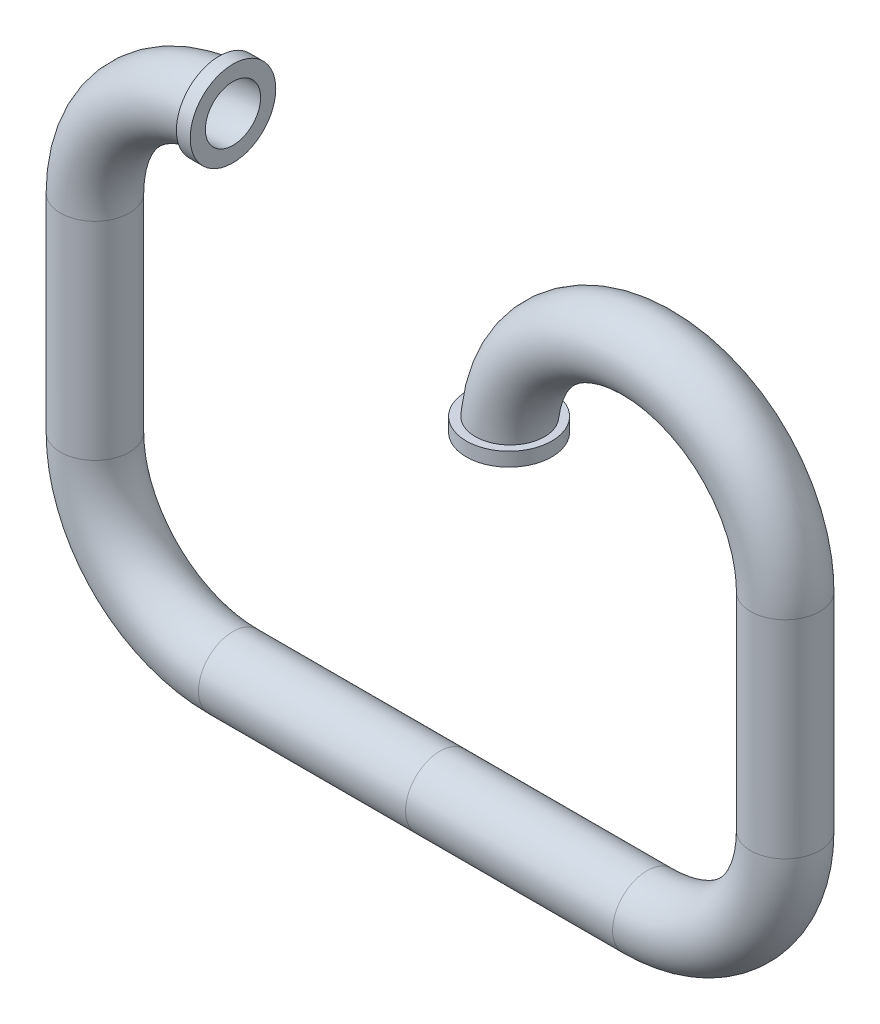
ISO-10303-21;
HEADER;
FILE_DESCRIPTION(('STEP AP214'),'2;1');
FILE_NAME('part.step','',(''),(''),'','','');
FILE_SCHEMA(('AUTOMOTIVE_DESIGN { 1 0 10303 214 1 1 1 1 }'));
ENDSEC;
DATA;
#1=APPLICATION_CONTEXT('core data for automotive mechanical design processes');
#2=APPLICATION_PROTOCOL_DEFINITION('international standard','automotive_design',2000,#1);
#3=PRODUCT_CONTEXT('',#1,'mechanical');
#4=PRODUCT('Part','Part','',(#3));
#5=PRODUCT_RELATED_PRODUCT_CATEGORY('part','',(#4));
#6=PRODUCT_DEFINITION_FORMATION('','',#4);
#7=PRODUCT_DEFINITION_CONTEXT('part definition',#1,'design');
#8=PRODUCT_DEFINITION('design','',#6,#7);
#9=PRODUCT_DEFINITION_SHAPE('','',#8);
#10=(LENGTH_UNIT() NAMED_UNIT(*) SI_UNIT(.MILLI.,.METRE.));
#11=(NAMED_UNIT(*) PLANE_ANGLE_UNIT() SI_UNIT($,.RADIAN.));
#12=(NAMED_UNIT(*) SI_UNIT($,.STERADIAN.) SOLID_ANGLE_UNIT());
#13=UNCERTAINTY_MEASURE_WITH_UNIT(LENGTH_MEASURE(1.E-05),#10,'distance_accuracy_value','');
#14=(GEOMETRIC_REPRESENTATION_CONTEXT(3) GLOBAL_UNCERTAINTY_ASSIGNED_CONTEXT((#13)) GLOBAL_UNIT_ASSIGNED_CONTEXT((#10,
#11,#12)) REPRESENTATION_CONTEXT('',''));
#15=CARTESIAN_POINT('',(0.,0.,0.));
#16=DIRECTION('',(0.,0.,1.));
#17=DIRECTION('',(1.,0.,0.));
#18=AXIS2_PLACEMENT_3D('',#15,#16,#17);
#19=CARTESIAN_POINT('',(-1.,0.,0.));
#20=DIRECTION('',(0.,0.,-1.));
#21=DIRECTION('',(-1.,0.,0.));
#22=AXIS2_PLACEMENT_3D('',#19,#20,#21);
#23=TOROIDAL_SURFACE('',#22,1.,0.25);
#24=CARTESIAN_POINT('',(-2.,0.,0.));
#25=DIRECTION('',(0.,-1.,0.));
#26=DIRECTION('',(1.,0.,0.));
#27=AXIS2_PLACEMENT_3D('',#24,#25,#26);
#28=CIRCLE('',#27,0.25);
#29=CARTESIAN_POINT('',(-1.75,0.,0.));
#30=VERTEX_POINT('',#29);
#31=EDGE_CURVE('E70',#30,#30,#28,.T.);
#32=ORIENTED_EDGE('',*,*,#31,.F.);
#33=EDGE_LOOP('',(#32));
#34=FACE_BOUND('',#33,.T.);
#35=CARTESIAN_POINT('',(-1.1,0.798598903682392,-0.156239637939055));
#36=CARTESIAN_POINT('',(-1.1,0.807484618255236,-0.167252077609579));
#37=CARTESIAN_POINT('',(-1.1,0.817311544826018,-0.177518916216291));
#38=CARTESIAN_POINT('',(-1.1,0.838559793603693,-0.196263733860563));
#39=CARTESIAN_POINT('',(-1.1,0.849983168244314,-0.204739374280309));
#40=CARTESIAN_POINT('',(-1.1,0.874081969106657,-0.21965059164289));
#41=CARTESIAN_POINT('',(-1.1,0.886756519343001,-0.226087582802604));
#42=CARTESIAN_POINT('',(-1.1,0.91300023448786,-0.236747922206686));
#43=CARTESIAN_POINT('',(-1.1,0.926569163740225,-0.240971850957424));
#44=CARTESIAN_POINT('',(-1.1,0.954266098089081,-0.247100376432861));
#45=CARTESIAN_POINT('',(-1.1,0.968395725822489,-0.248997644239264));
#46=CARTESIAN_POINT('',(-1.1,0.996773707944956,-0.25039290443244));
#47=CARTESIAN_POINT('',(-1.1,1.01102206788375,-0.249890784032819));
#48=CARTESIAN_POINT('',(-1.1,1.03922913334701,-0.246498215551317));
#49=CARTESIAN_POINT('',(-1.1,1.0531878915475,-0.243608205779841));
#50=CARTESIAN_POINT('',(-1.1,1.08041932555232,-0.235518387044002));
#51=CARTESIAN_POINT('',(-1.1,1.09369201220856,-0.230318614626673));
#52=CARTESIAN_POINT('',(-1.1,1.11913001861259,-0.217773097139499));
#53=CARTESIAN_POINT('',(-1.1,1.13129864492456,-0.210434057268884));
#54=CARTESIAN_POINT('',(-1.1,1.15422440361082,-0.19380938875738));
#55=CARTESIAN_POINT('',(-1.1,1.16498156794405,-0.184523804203367));
#56=CARTESIAN_POINT('',(-1.1,1.18473296660521,-0.164309957154077));
#57=CARTESIAN_POINT('',(-1.1,1.19373414042714,-0.153388475286226));
#58=CARTESIAN_POINT('',(-1.1,1.20976742880129,-0.130184858647995));
#59=CARTESIAN_POINT('',(-1.1,1.2167995799634,-0.117902749181585));
#60=CARTESIAN_POINT('',(-1.1,1.22866989147601,-0.0923732303855615));
#61=CARTESIAN_POINT('',(-1.1,1.23351568693935,-0.079129370795655));
#62=CARTESIAN_POINT('',(-1.1,1.24090948117469,-0.0520150874536928));
#63=CARTESIAN_POINT('',(-1.1,1.24345751315272,-0.0381446727593141));
#64=CARTESIAN_POINT('',(-1.1,1.24617903253143,-0.0102038849674363));
#65=CARTESIAN_POINT('',(-1.1,1.24635775803878,0.00386597816705049));
#66=CARTESIAN_POINT('',(-1.1,1.2443490557881,0.0318357092211728));
#67=CARTESIAN_POINT('',(-1.1,1.24216164206245,0.0457355781484649));
#68=CARTESIAN_POINT('',(-1.1,1.23548566564956,0.0729628531749481));
#69=CARTESIAN_POINT('',(-1.1,1.23099839651049,0.0862905765141689));
#70=CARTESIAN_POINT('',(-1.1,1.21985250641525,0.112004722408348));
#71=CARTESIAN_POINT('',(-1.1,1.2131938798134,0.124391142515752));
#72=CARTESIAN_POINT('',(-1.1,1.19788731542389,0.147887218294668));
#73=CARTESIAN_POINT('',(-1.1,1.18923708938565,0.158995383124043));
#74=CARTESIAN_POINT('',(-1.1,1.17019911655826,0.179606640126358));
#75=CARTESIAN_POINT('',(-1.1,1.15981135014478,0.189109714168458));
#76=CARTESIAN_POINT('',(-1.1,1.13756371948689,0.206269460174094));
#77=CARTESIAN_POINT('',(-1.1,1.1256999380033,0.213921053042685));
#78=CARTESIAN_POINT('',(-1.1,1.1008600065118,0.227132541762658));
#79=CARTESIAN_POINT('',(-1.1,1.08788383586549,0.232692398795301));
#80=CARTESIAN_POINT('',(-1.1,1.06113487356717,0.241585432017897));
#81=CARTESIAN_POINT('',(-1.1,1.04735924079537,0.24491006219374));
#82=CARTESIAN_POINT('',(-1.1,1.01944604647422,0.249209299271431));
#83=CARTESIAN_POINT('',(-1.1,1.00530847649482,0.250183851386031));
#84=CARTESIAN_POINT('',(-1.1,0.977013676572304,0.249758171980877));
#85=CARTESIAN_POINT('',(-1.1,0.962856586441287,0.248348625861424));
#86=CARTESIAN_POINT('',(-1.1,0.934978226305414,0.243178774257247));
#87=CARTESIAN_POINT('',(-1.1,0.921256964456819,0.239418424805864));
#88=CARTESIAN_POINT('',(-1.1,0.894606137350386,0.229641253917731));
#89=CARTESIAN_POINT('',(-1.1,0.881678530011489,0.223619093935772));
#90=CARTESIAN_POINT('',(-1.1,0.857019113242032,0.209487505095425));
#91=CARTESIAN_POINT('',(-1.1,0.845287309521206,0.20137806627133));
#92=CARTESIAN_POINT('',(-1.1,0.823370738982209,0.183309172670559));
#93=CARTESIAN_POINT('',(-1.1,0.813184120587847,0.173351964393591));
#94=CARTESIAN_POINT('',(-1.1,0.794638704052553,0.15185994909619));
#95=CARTESIAN_POINT('',(-1.1,0.786279857421169,0.140325183941254));
#96=CARTESIAN_POINT('',(-1.1,0.771681279589618,0.116074864617453));
#97=CARTESIAN_POINT('',(-1.1,0.765429652543108,0.10336647310674));
#98=CARTESIAN_POINT('',(-1.1,0.755168543349376,0.0770751991823277));
#99=CARTESIAN_POINT('',(-1.1,0.751158856651886,0.0634923966743228));
#100=CARTESIAN_POINT('',(-1.1,0.745526882823232,0.0359545442264933));
#101=CARTESIAN_POINT('',(-1.1,0.743885669678652,0.0220033627581728));
#102=CARTESIAN_POINT('',(-1.1,0.74298034692899,-0.00597955267888335));
#103=CARTESIAN_POINT('',(-1.1,0.743716757423658,-0.0200113036018261));
#104=CARTESIAN_POINT('',(-1.1,0.74753647692591,-0.0476924426774219));
#105=CARTESIAN_POINT('',(-1.1,0.750610365346217,-0.0613431382070539));
#106=CARTESIAN_POINT('',(-1.1,0.758999581108099,-0.0879247327922061));
#107=CARTESIAN_POINT('',(-1.1,0.764312213341436,-0.100856476238293));
#108=CARTESIAN_POINT('',(-1.1,0.774564130392535,-0.120867695525504));
#109=CARTESIAN_POINT('',(-1.1,0.778860177938196,-0.128284026486041));
#110=CARTESIAN_POINT('',(-1.1,0.788188886205849,-0.142637803870627));
#111=CARTESIAN_POINT('',(-1.1,0.793221545166893,-0.149575251439439));
#112=CARTESIAN_POINT('',(-1.1,0.798598903682392,-0.156239637939055));
#113=B_SPLINE_CURVE_WITH_KNOTS('',3,(#35,#36,#37,#38,#39,#40,#41,#42,#43,#44,#45,#46,#47,#48,
#49,#50,#51,#52,#53,#54,#55,#56,#57,#58,#59,#60,#61,#62,#63,#64,#65,#66,#67,#68,#69,#70,#71,#72,
#73,#74,#75,#76,#77,#78,#79,#80,#81,#82,#83,#84,#85,#86,#87,#88,#89,#90,#91,#92,#93,#94,#95,#96,
#97,#98,#99,#100,#101,#102,#103,#104,#105,#106,#107,#108,#109,#110,#111,#112),.UNSPECIFIED.,.T.,
.F.,(4,2,2,2,2,2,2,2,2,2,2,2,2,2,2,2,2,2,2,2,2,2,2,2,2,2,2,2,2,2,2,2,2,2,2,2,2,2,4),(0.,
0.042419277218481,0.084893600183786,0.127338393721264,0.16977204802275,0.21233902665477,
0.254908006223219,0.297469173753552,0.340029667868764,0.382458171419216,0.424885714119334,
0.467142031024321,0.509397562208715,0.551504365817851,0.593610560912517,0.635623651286504,
0.677636492503143,0.719625729586843,0.76161507584624,0.803652908716627,0.845691216407669,
0.88784357092604,0.929996707675384,0.972310107021951,1.01462449280908,1.05710458176961,
1.09958546525149,1.14216725288102,1.18474924382094,1.22727979920904,1.26980922613231,
1.3120943759003,1.35437566702383,1.39631718923708,1.43826788668425,1.48005040315259,
1.52178276285504,1.54745365347394,1.57312448272488),.UNSPECIFIED.);
#114=CARTESIAN_POINT('',(-1.1,0.798598903682392,-0.156239637939055));
#115=VERTEX_POINT('',#114);
#116=EDGE_CURVE('E12',#115,#115,#113,.T.);
#117=ORIENTED_EDGE('',*,*,#116,.F.);
#118=EDGE_LOOP('',(#117));
#119=FACE_BOUND('',#118,.T.);
#120=ADVANCED_FACE('F40',(#34,#119),#23,.T.);
#121=CARTESIAN_POINT('',(0.5,0.,0.));
#122=DIRECTION('',(1.,0.,0.));
#123=DIRECTION('',(0.,0.,-1.));
#124=AXIS2_PLACEMENT_3D('',#121,#122,#123);
#125=PLANE('',#124);
#126=CARTESIAN_POINT('',(0.5,-2.5,0.));
#127=DIRECTION('',(1.,0.,0.));
#128=DIRECTION('',(0.,0.,-1.));
#129=AXIS2_PLACEMENT_3D('',#126,#127,#128);
#130=CIRCLE('',#129,0.2);
#131=CARTESIAN_POINT('',(0.5,-2.5,-0.2));
#132=VERTEX_POINT('',#131);
#133=EDGE_CURVE('E60',#132,#132,#130,.F.);
#134=ORIENTED_EDGE('',*,*,#133,.T.);
#135=EDGE_LOOP('',(#134));
#136=FACE_BOUND('',#135,.T.);
#137=CARTESIAN_POINT('',(0.5,-2.5,0.));
#138=DIRECTION('',(1.,0.,0.));
#139=DIRECTION('',(0.,0.,-1.));
#140=AXIS2_PLACEMENT_3D('',#137,#138,#139);
#141=CIRCLE('',#140,0.25);
#142=CARTESIAN_POINT('',(0.5,-2.5,-0.25));
#143=VERTEX_POINT('',#142);
#144=EDGE_CURVE('E55',#143,#143,#141,.F.);
#145=ORIENTED_EDGE('',*,*,#144,.F.);
#146=EDGE_LOOP('',(#145));
#147=FACE_BOUND('',#146,.T.);
#148=ADVANCED_FACE('F117',(#136,#147),#125,.T.);
#149=CARTESIAN_POINT('',(-1.,-2.5,0.));
#150=DIRECTION('',(1.,0.,0.));
#151=DIRECTION('',(0.,1.,0.));
#152=AXIS2_PLACEMENT_3D('',#149,#150,#151);
#153=CYLINDRICAL_SURFACE('',#152,0.25);
#154=CARTESIAN_POINT('',(-1.,-2.5,0.));
#155=DIRECTION('',(1.,0.,0.));
#156=DIRECTION('',(0.,1.,0.));
#157=AXIS2_PLACEMENT_3D('',#154,#155,#156);
#158=CIRCLE('',#157,0.25);
#159=CARTESIAN_POINT('',(-1.,-2.75,0.));
#160=VERTEX_POINT('',#159);
#161=EDGE_CURVE('E79',#160,#160,#158,.T.);
#162=ORIENTED_EDGE('',*,*,#161,.T.);
#163=EDGE_LOOP('',(#162));
#164=FACE_BOUND('',#163,.T.);
#165=ORIENTED_EDGE('',*,*,#144,.T.);
#166=EDGE_LOOP('',(#165));
#167=FACE_BOUND('',#166,.T.);
#168=ADVANCED_FACE('F123',(#164,#167),#153,.T.);
#169=CARTESIAN_POINT('',(-1.,-2.5,0.));
#170=DIRECTION('',(1.,0.,0.));
#171=DIRECTION('',(0.,1.,0.));
#172=AXIS2_PLACEMENT_3D('',#169,#170,#171);
#173=CYLINDRICAL_SURFACE('',#172,0.2);
#174=CARTESIAN_POINT('',(-1.,-2.5,0.));
#175=DIRECTION('',(1.,0.,0.));
#176=DIRECTION('',(0.,0.,1.));
#177=AXIS2_PLACEMENT_3D('',#174,#175,#176);
#178=CIRCLE('',#177,0.2);
#179=CARTESIAN_POINT('',(-1.,-2.7,0.));
#180=VERTEX_POINT('',#179);
#181=EDGE_CURVE('E51',#180,#180,#178,.T.);
#182=ORIENTED_EDGE('',*,*,#181,.F.);
#183=EDGE_LOOP('',(#182));
#184=FACE_BOUND('',#183,.T.);
#185=ORIENTED_EDGE('',*,*,#133,.F.);
#186=EDGE_LOOP('',(#185));
#187=FACE_BOUND('',#186,.T.);
#188=ADVANCED_FACE('F42',(#184,#187),#173,.F.);
#189=CARTESIAN_POINT('',(-1.,0.,0.));
#190=DIRECTION('',(1.,0.,0.));
#191=DIRECTION('',(0.,0.,-1.));
#192=AXIS2_PLACEMENT_3D('',#189,#190,#191);
#193=PLANE('',#192);
#194=CARTESIAN_POINT('',(-1.,1.,0.));
#195=DIRECTION('',(1.,0.,0.));
#196=DIRECTION('',(0.,0.,-1.));
#197=AXIS2_PLACEMENT_3D('',#194,#195,#196);
#198=CIRCLE('',#197,0.31);
#199=CARTESIAN_POINT('',(-1.,1.,-0.31));
#200=VERTEX_POINT('',#199);
#201=EDGE_CURVE('E87',#200,#200,#198,.T.);
#202=ORIENTED_EDGE('',*,*,#201,.T.);
#203=EDGE_LOOP('',(#202));
#204=FACE_BOUND('',#203,.T.);
#205=CARTESIAN_POINT('',(-1.,1.,0.));
#206=DIRECTION('',(1.,0.,0.));
#207=DIRECTION('',(0.,0.,-1.));
#208=AXIS2_PLACEMENT_3D('',#205,#206,#207);
#209=CIRCLE('',#208,0.2);
#210=CARTESIAN_POINT('',(-1.,1.2,0.));
#211=VERTEX_POINT('',#210);
#212=EDGE_CURVE('E63',#211,#211,#209,.T.);
#213=ORIENTED_EDGE('',*,*,#212,.F.);
#214=EDGE_LOOP('',(#213));
#215=FACE_BOUND('',#214,.T.);
#216=ADVANCED_FACE('F111',(#204,#215),#193,.T.);
#217=CARTESIAN_POINT('',(-2.,0.,0.));
#218=DIRECTION('',(0.,-1.,0.));
#219=DIRECTION('',(1.,0.,0.));
#220=AXIS2_PLACEMENT_3D('',#217,#218,#219);
#221=CYLINDRICAL_SURFACE('',#220,0.25);
#222=ORIENTED_EDGE('',*,*,#31,.T.);
#223=EDGE_LOOP('',(#222));
#224=FACE_BOUND('',#223,.T.);
#225=CARTESIAN_POINT('',(-2.,-1.5,0.));
#226=DIRECTION('',(0.,1.,0.));
#227=DIRECTION('',(-1.,0.,0.));
#228=AXIS2_PLACEMENT_3D('',#225,#226,#227);
#229=CIRCLE('',#228,0.25);
#230=CARTESIAN_POINT('',(-2.25,-1.5,0.));
#231=VERTEX_POINT('',#230);
#232=EDGE_CURVE('E66',#231,#231,#229,.F.);
#233=ORIENTED_EDGE('',*,*,#232,.F.);
#234=EDGE_LOOP('',(#233));
#235=FACE_BOUND('',#234,.T.);
#236=ADVANCED_FACE('F125',(#224,#235),#221,.T.);
#237=CARTESIAN_POINT('',(-1.,-1.5,0.));
#238=DIRECTION('',(0.,0.,1.));
#239=DIRECTION('',(1.,0.,0.));
#240=AXIS2_PLACEMENT_3D('',#237,#238,#239);
#241=TOROIDAL_SURFACE('',#240,1.,0.25);
#242=CARTESIAN_POINT('',(-1.,-1.5,0.));
#243=DIRECTION('',(0.,0.,1.));
#244=DIRECTION('',(1.,0.,0.));
#245=AXIS2_PLACEMENT_3D('',#242,#243,#244);
#246=CIRCLE('',#245,1.25);
#247=EDGE_CURVE('',#231,#160,#246,.T.);
#248=ORIENTED_EDGE('',*,*,#232,.T.);
#249=ORIENTED_EDGE('',*,*,#161,.F.);
#250=ORIENTED_EDGE('',*,*,#247,.T.);
#251=ORIENTED_EDGE('',*,*,#247,.F.);
#252=EDGE_LOOP('',(#248,#250,#249,#251));
#253=FACE_BOUND('',#252,.T.);
#254=ADVANCED_FACE('F112',(#253),#241,.T.);
#255=CARTESIAN_POINT('',(-2.,0.,0.));
#256=DIRECTION('',(0.,-1.,0.));
#257=DIRECTION('',(1.,0.,0.));
#258=AXIS2_PLACEMENT_3D('',#255,#256,#257);
#259=CYLINDRICAL_SURFACE('',#258,0.2);
#260=CARTESIAN_POINT('',(-2.,0.,0.));
#261=DIRECTION('',(0.,-1.,0.));
#262=DIRECTION('',(0.,0.,1.));
#263=AXIS2_PLACEMENT_3D('',#260,#261,#262);
#264=CIRCLE('',#263,0.2);
#265=CARTESIAN_POINT('',(-2.2,0.,0.));
#266=VERTEX_POINT('',#265);
#267=EDGE_CURVE('E85',#266,#266,#264,.T.);
#268=ORIENTED_EDGE('',*,*,#267,.F.);
#269=EDGE_LOOP('',(#268));
#270=FACE_BOUND('',#269,.T.);
#271=CARTESIAN_POINT('',(-2.,-1.5,0.));
#272=DIRECTION('',(0.,-1.,0.));
#273=DIRECTION('',(0.,0.,1.));
#274=AXIS2_PLACEMENT_3D('',#271,#272,#273);
#275=CIRCLE('',#274,0.2);
#276=CARTESIAN_POINT('',(-2.2,-1.5,0.));
#277=VERTEX_POINT('',#276);
#278=EDGE_CURVE('E75',#277,#277,#275,.T.);
#279=ORIENTED_EDGE('',*,*,#278,.T.);
#280=EDGE_LOOP('',(#279));
#281=FACE_BOUND('',#280,.T.);
#282=ADVANCED_FACE('F99',(#270,#281),#259,.F.);
#283=CARTESIAN_POINT('',(-1.,-1.5,0.));
#284=DIRECTION('',(0.,0.,1.));
#285=DIRECTION('',(1.,0.,0.));
#286=AXIS2_PLACEMENT_3D('',#283,#284,#285);
#287=TOROIDAL_SURFACE('',#286,1.,0.2);
#288=CARTESIAN_POINT('',(-1.,-1.5,0.));
#289=DIRECTION('',(0.,0.,1.));
#290=DIRECTION('',(1.,0.,0.));
#291=AXIS2_PLACEMENT_3D('',#288,#289,#290);
#292=CIRCLE('',#291,1.2);
#293=EDGE_CURVE('',#277,#180,#292,.T.);
#294=ORIENTED_EDGE('',*,*,#278,.F.);
#295=ORIENTED_EDGE('',*,*,#181,.T.);
#296=ORIENTED_EDGE('',*,*,#293,.T.);
#297=ORIENTED_EDGE('',*,*,#293,.F.);
#298=EDGE_LOOP('',(#294,#296,#295,#297));
#299=FACE_BOUND('',#298,.T.);
#300=ADVANCED_FACE('F101',(#299),#287,.F.);
#301=CARTESIAN_POINT('',(-1.,0.,0.));
#302=DIRECTION('',(0.,0.,-1.));
#303=DIRECTION('',(-1.,0.,0.));
#304=AXIS2_PLACEMENT_3D('',#301,#302,#303);
#305=TOROIDAL_SURFACE('',#304,1.,0.2);
#306=CARTESIAN_POINT('',(-1.,0.,0.));
#307=DIRECTION('',(0.,0.,-1.));
#308=DIRECTION('',(-1.,0.,0.));
#309=AXIS2_PLACEMENT_3D('',#306,#307,#308);
#310=CIRCLE('',#309,1.2);
#311=EDGE_CURVE('',#266,#211,#310,.T.);
#312=ORIENTED_EDGE('',*,*,#267,.T.);
#313=ORIENTED_EDGE('',*,*,#212,.T.);
#314=ORIENTED_EDGE('',*,*,#311,.T.);
#315=ORIENTED_EDGE('',*,*,#311,.F.);
#316=EDGE_LOOP('',(#312,#314,#313,#315));
#317=FACE_BOUND('',#316,.T.);
#318=ADVANCED_FACE('F103',(#317),#305,.F.);
#319=CARTESIAN_POINT('',(-1.1,1.,0.));
#320=DIRECTION('',(1.,0.,0.));
#321=DIRECTION('',(0.,0.,-1.));
#322=AXIS2_PLACEMENT_3D('',#319,#320,#321);
#323=PLANE('',#322);
#324=CARTESIAN_POINT('',(-1.1,1.,0.));
#325=DIRECTION('',(1.,0.,0.));
#326=DIRECTION('',(0.,0.,-1.));
#327=AXIS2_PLACEMENT_3D('',#324,#325,#326);
#328=CIRCLE('',#327,0.31);
#329=CARTESIAN_POINT('',(-1.1,1.,-0.310000000000001));
#330=VERTEX_POINT('',#329);
#331=EDGE_CURVE('E81',#330,#330,#328,.T.);
#332=ORIENTED_EDGE('',*,*,#331,.F.);
#333=EDGE_LOOP('',(#332));
#334=FACE_BOUND('',#333,.T.);
#335=ORIENTED_EDGE('',*,*,#116,.T.);
#336=EDGE_LOOP('',(#335));
#337=FACE_BOUND('',#336,.T.);
#338=ADVANCED_FACE('F109',(#334,#337),#323,.F.);
#339=CARTESIAN_POINT('',(-1.1,1.,0.));
#340=DIRECTION('',(1.,0.,0.));
#341=DIRECTION('',(0.,0.,-1.));
#342=AXIS2_PLACEMENT_3D('',#339,#340,#341);
#343=CYLINDRICAL_SURFACE('',#342,0.31);
#344=ORIENTED_EDGE('',*,*,#331,.T.);
#345=EDGE_LOOP('',(#344));
#346=FACE_BOUND('',#345,.T.);
#347=ORIENTED_EDGE('',*,*,#201,.F.);
#348=EDGE_LOOP('',(#347));
#349=FACE_BOUND('',#348,.T.);
#350=ADVANCED_FACE('F214',(#346,#349),#343,.T.);
#351=CLOSED_SHELL('',(#120,#148,#168,#188,#216,#236,#254,#282,#300,#318,#338,#350));
#352=MANIFOLD_SOLID_BREP('B2',#351);
#353=CARTESIAN_POINT('',(0.5,0.,0.));
#354=DIRECTION('',(1.,0.,0.));
#355=DIRECTION('',(0.,0.,-1.));
#356=AXIS2_PLACEMENT_3D('',#353,#354,#355);
#357=PLANE('',#356);
#358=CARTESIAN_POINT('',(0.5,-2.5,0.));
#359=DIRECTION('',(1.,0.,0.));
#360=DIRECTION('',(0.,0.,-1.));
#361=AXIS2_PLACEMENT_3D('',#358,#359,#360);
#362=CIRCLE('',#361,0.25);
#363=CARTESIAN_POINT('',(0.5,-2.5,-0.25));
#364=VERTEX_POINT('',#363);
#365=EDGE_CURVE('E39',#364,#364,#362,.F.);
#366=ORIENTED_EDGE('',*,*,#365,.T.);
#367=EDGE_LOOP('',(#366));
#368=FACE_BOUND('',#367,.T.);
#369=CARTESIAN_POINT('',(0.5,-2.5,0.));
#370=DIRECTION('',(1.,0.,0.));
#371=DIRECTION('',(0.,0.,-1.));
#372=AXIS2_PLACEMENT_3D('',#369,#370,#371);
#373=CIRCLE('',#372,0.2);
#374=CARTESIAN_POINT('',(0.5,-2.5,-0.2));
#375=VERTEX_POINT('',#374);
#376=EDGE_CURVE('E240',#375,#375,#373,.F.);
#377=ORIENTED_EDGE('',*,*,#376,.F.);
#378=EDGE_LOOP('',(#377));
#379=FACE_BOUND('',#378,.T.);
#380=ADVANCED_FACE('F234',(#368,#379),#357,.F.);
#381=CARTESIAN_POINT('',(-1.,-2.5,0.));
#382=DIRECTION('',(1.,0.,0.));
#383=DIRECTION('',(0.,1.,0.));
#384=AXIS2_PLACEMENT_3D('',#381,#382,#383);
#385=CYLINDRICAL_SURFACE('',#384,0.25);
#386=ORIENTED_EDGE('',*,*,#365,.F.);
#387=EDGE_LOOP('',(#386));
#388=FACE_BOUND('',#387,.T.);
#389=CARTESIAN_POINT('',(2.,-2.5,0.));
#390=DIRECTION('',(1.,0.,0.));
#391=DIRECTION('',(0.,1.,0.));
#392=AXIS2_PLACEMENT_3D('',#389,#390,#391);
#393=CIRCLE('',#392,0.25);
#394=CARTESIAN_POINT('',(2.,-2.75,0.));
#395=VERTEX_POINT('',#394);
#396=EDGE_CURVE('E244',#395,#395,#393,.T.);
#397=ORIENTED_EDGE('',*,*,#396,.F.);
#398=EDGE_LOOP('',(#397));
#399=FACE_BOUND('',#398,.T.);
#400=ADVANCED_FACE('F277',(#388,#399),#385,.T.);
#401=CARTESIAN_POINT('',(1.,0.,0.));
#402=DIRECTION('',(0.,1.,0.));
#403=DIRECTION('',(0.,0.,1.));
#404=AXIS2_PLACEMENT_3D('',#401,#402,#403);
#405=PLANE('',#404);
#406=CARTESIAN_POINT('',(1.,0.,0.));
#407=DIRECTION('',(0.,-1.,0.));
#408=DIRECTION('',(0.,0.,1.));
#409=AXIS2_PLACEMENT_3D('',#406,#407,#408);
#410=CIRCLE('',#409,0.2);
#411=CARTESIAN_POINT('',(0.800000000000001,0.,0.));
#412=VERTEX_POINT('',#411);
#413=EDGE_CURVE('E258',#412,#412,#410,.T.);
#414=ORIENTED_EDGE('',*,*,#413,.F.);
#415=EDGE_LOOP('',(#414));
#416=FACE_BOUND('',#415,.T.);
#417=CARTESIAN_POINT('',(1.,0.,0.));
#418=DIRECTION('',(0.,-1.,0.));
#419=DIRECTION('',(0.,0.,1.));
#420=AXIS2_PLACEMENT_3D('',#417,#418,#419);
#421=CIRCLE('',#420,0.31);
#422=CARTESIAN_POINT('',(1.,0.,0.31));
#423=VERTEX_POINT('',#422);
#424=EDGE_CURVE('E321',#423,#423,#421,.T.);
#425=ORIENTED_EDGE('',*,*,#424,.T.);
#426=EDGE_LOOP('',(#425));
#427=FACE_BOUND('',#426,.T.);
#428=ADVANCED_FACE('F279',(#416,#427),#405,.F.);
#429=CARTESIAN_POINT('',(2.,0.,0.));
#430=DIRECTION('',(0.,0.,-1.));
#431=DIRECTION('',(1.,0.,0.));
#432=AXIS2_PLACEMENT_3D('',#429,#430,#431);
#433=TOROIDAL_SURFACE('',#432,1.,0.2);
#434=CARTESIAN_POINT('',(3.,0.,0.));
#435=DIRECTION('',(0.,1.,0.));
#436=DIRECTION('',(0.,0.,1.));
#437=AXIS2_PLACEMENT_3D('',#434,#435,#436);
#438=CIRCLE('',#437,0.2);
#439=CARTESIAN_POINT('',(3.2,0.,0.));
#440=VERTEX_POINT('',#439);
#441=EDGE_CURVE('E328',#440,#440,#438,.T.);
#442=CARTESIAN_POINT('',(2.,0.,0.));
#443=DIRECTION('',(0.,0.,-1.));
#444=DIRECTION('',(1.,0.,0.));
#445=AXIS2_PLACEMENT_3D('',#442,#443,#444);
#446=CIRCLE('',#445,1.2);
#447=EDGE_CURVE('',#412,#440,#446,.T.);
#448=ORIENTED_EDGE('',*,*,#413,.T.);
#449=ORIENTED_EDGE('',*,*,#441,.F.);
#450=ORIENTED_EDGE('',*,*,#447,.T.);
#451=ORIENTED_EDGE('',*,*,#447,.F.);
#452=EDGE_LOOP('',(#448,#450,#449,#451));
#453=FACE_BOUND('',#452,.T.);
#454=ADVANCED_FACE('F286',(#453),#433,.F.);
#455=CARTESIAN_POINT('',(3.,0.,0.));
#456=DIRECTION('',(0.,-1.,0.));
#457=DIRECTION('',(-1.,0.,0.));
#458=AXIS2_PLACEMENT_3D('',#455,#456,#457);
#459=CYLINDRICAL_SURFACE('',#458,0.2);
#460=ORIENTED_EDGE('',*,*,#441,.T.);
#461=EDGE_LOOP('',(#460));
#462=FACE_BOUND('',#461,.T.);
#463=CARTESIAN_POINT('',(3.,-1.5,0.));
#464=DIRECTION('',(0.,1.,0.));
#465=DIRECTION('',(0.,0.,1.));
#466=AXIS2_PLACEMENT_3D('',#463,#464,#465);
#467=CIRCLE('',#466,0.2);
#468=CARTESIAN_POINT('',(3.2,-1.5,0.));
#469=VERTEX_POINT('',#468);
#470=EDGE_CURVE('E331',#469,#469,#467,.T.);
#471=ORIENTED_EDGE('',*,*,#470,.F.);
#472=EDGE_LOOP('',(#471));
#473=FACE_BOUND('',#472,.T.);
#474=ADVANCED_FACE('F302',(#462,#473),#459,.F.);
#475=CARTESIAN_POINT('',(2.,-1.5,0.));
#476=DIRECTION('',(0.,0.,1.));
#477=DIRECTION('',(-1.,0.,0.));
#478=AXIS2_PLACEMENT_3D('',#475,#476,#477);
#479=TOROIDAL_SURFACE('',#478,1.,0.2);
#480=CARTESIAN_POINT('',(2.,-2.5,0.));
#481=DIRECTION('',(1.,0.,0.));
#482=DIRECTION('',(0.,0.,1.));
#483=AXIS2_PLACEMENT_3D('',#480,#481,#482);
#484=CIRCLE('',#483,0.2);
#485=CARTESIAN_POINT('',(2.,-2.7,0.));
#486=VERTEX_POINT('',#485);
#487=EDGE_CURVE('E334',#486,#486,#484,.T.);
#488=CARTESIAN_POINT('',(2.,-1.5,0.));
#489=DIRECTION('',(0.,0.,1.));
#490=DIRECTION('',(-1.,0.,0.));
#491=AXIS2_PLACEMENT_3D('',#488,#489,#490);
#492=CIRCLE('',#491,1.2);
#493=EDGE_CURVE('',#486,#469,#492,.T.);
#494=ORIENTED_EDGE('',*,*,#487,.F.);
#495=ORIENTED_EDGE('',*,*,#470,.T.);
#496=ORIENTED_EDGE('',*,*,#493,.T.);
#497=ORIENTED_EDGE('',*,*,#493,.F.);
#498=EDGE_LOOP('',(#494,#496,#495,#497));
#499=FACE_BOUND('',#498,.T.);
#500=ADVANCED_FACE('F276',(#499),#479,.F.);
#501=CARTESIAN_POINT('',(-1.,-2.5,0.));
#502=DIRECTION('',(1.,0.,0.));
#503=DIRECTION('',(0.,1.,0.));
#504=AXIS2_PLACEMENT_3D('',#501,#502,#503);
#505=CYLINDRICAL_SURFACE('',#504,0.2);
#506=ORIENTED_EDGE('',*,*,#376,.T.);
#507=EDGE_LOOP('',(#506));
#508=FACE_BOUND('',#507,.T.);
#509=ORIENTED_EDGE('',*,*,#487,.T.);
#510=EDGE_LOOP('',(#509));
#511=FACE_BOUND('',#510,.T.);
#512=ADVANCED_FACE('F273',(#508,#511),#505,.F.);
#513=CARTESIAN_POINT('',(1.,0.0999999999999996,0.));
#514=DIRECTION('',(0.,-1.,0.));
#515=DIRECTION('',(0.,0.,-1.));
#516=AXIS2_PLACEMENT_3D('',#513,#514,#515);
#517=CYLINDRICAL_SURFACE('',#516,0.31);
#518=CARTESIAN_POINT('',(1.,0.0999999999999996,0.));
#519=DIRECTION('',(0.,-1.,0.));
#520=DIRECTION('',(0.,0.,1.));
#521=AXIS2_PLACEMENT_3D('',#518,#519,#520);
#522=CIRCLE('',#521,0.31);
#523=CARTESIAN_POINT('',(1.,0.0999999999999996,0.31));
#524=VERTEX_POINT('',#523);
#525=EDGE_CURVE('E259',#524,#524,#522,.T.);
#526=ORIENTED_EDGE('',*,*,#525,.T.);
#527=EDGE_LOOP('',(#526));
#528=FACE_BOUND('',#527,.T.);
#529=ORIENTED_EDGE('',*,*,#424,.F.);
#530=EDGE_LOOP('',(#529));
#531=FACE_BOUND('',#530,.T.);
#532=ADVANCED_FACE('F275',(#528,#531),#517,.T.);
#533=CARTESIAN_POINT('',(1.,0.0999999999999996,0.));
#534=DIRECTION('',(0.,1.,0.));
#535=DIRECTION('',(0.,0.,1.));
#536=AXIS2_PLACEMENT_3D('',#533,#534,#535);
#537=PLANE('',#536);
#538=ORIENTED_EDGE('',*,*,#525,.F.);
#539=EDGE_LOOP('',(#538));
#540=FACE_BOUND('',#539,.T.);
#541=CARTESIAN_POINT('',(1.20140109631761,0.0999999999999994,-0.156239637939055));
#542=CARTESIAN_POINT('',(1.21019061571474,0.0999999999999994,-0.145344468335609));
#543=CARTESIAN_POINT('',(1.21807172210946,0.0999999999999994,-0.133703962300581));
#544=CARTESIAN_POINT('',(1.23177790310757,0.0999999999999994,-0.109257379143088));
#545=CARTESIAN_POINT('',(1.237600690406,0.0999999999999994,-0.096450025107835));
#546=CARTESIAN_POINT('',(1.24700765016561,0.0999999999999994,-0.0700386597896411));
#547=CARTESIAN_POINT('',(1.25059219436236,0.0999999999999994,-0.0564347812071185));
#548=CARTESIAN_POINT('',(1.25541318839992,0.0999999999999994,-0.0288206461573356));
#549=CARTESIAN_POINT('',(1.25665023046536,0.0999999999999994,-0.014810493090211));
#550=CARTESIAN_POINT('',(1.25674012956133,0.0999999999999994,0.0131538110387401));
#551=CARTESIAN_POINT('',(1.25560376128764,0.0999999999999994,0.0271079282969863));
#552=CARTESIAN_POINT('',(1.25100317267413,0.0999999999999994,0.0546272137432173));
#553=CARTESIAN_POINT('',(1.24753888231816,0.0999999999999994,0.0681923702197628));
#554=CARTESIAN_POINT('',(1.23838863374503,0.0999999999999994,0.0945453892648773));
#555=CARTESIAN_POINT('',(1.23270348712941,0.0999999999999994,0.107333533818285));
#556=CARTESIAN_POINT('',(1.21927977306228,0.0999999999999994,0.131782096781474));
#557=CARTESIAN_POINT('',(1.21154114762927,0.0999999999999994,0.143442483335476));
#558=CARTESIAN_POINT('',(1.19418083260693,0.0999999999999995,0.16538311643698));
#559=CARTESIAN_POINT('',(1.18454778916345,0.0999999999999995,0.175654378083549));
#560=CARTESIAN_POINT('',(1.16370586490868,0.0999999999999995,0.194449314988614));
#561=CARTESIAN_POINT('',(1.15249692087162,0.0999999999999995,0.202972920096664));
#562=CARTESIAN_POINT('',(1.12872743217782,0.0999999999999995,0.218098495866874));
#563=CARTESIAN_POINT('',(1.11615711045901,0.0999999999999995,0.224685104803622));
#564=CARTESIAN_POINT('',(1.09009255829582,0.0999999999999995,0.235665425768117));
#565=CARTESIAN_POINT('',(1.07659830142009,0.0999999999999995,0.240059075031189));
#566=CARTESIAN_POINT('',(1.0490037254833,0.0999999999999996,0.246545191192852));
#567=CARTESIAN_POINT('',(1.03490096979586,0.0999999999999996,0.248627297728038));
#568=CARTESIAN_POINT('',(1.00654593496887,0.0999999999999996,0.250394447161815));
#569=CARTESIAN_POINT('',(0.992293655189753,0.0999999999999996,0.250079479803207));
#570=CARTESIAN_POINT('',(0.964044783835867,0.0999999999999996,0.247058139402245));
#571=CARTESIAN_POINT('',(0.95004818958155,0.0999999999999996,0.244351791435899));
#572=CARTESIAN_POINT('',(0.922710586450209,0.0999999999999997,0.236620477359455));
#573=CARTESIAN_POINT('',(0.909369569109577,0.0999999999999997,0.23159554119143));
#574=CARTESIAN_POINT('',(0.883765586512359,0.0999999999999997,0.219384869006445));
#575=CARTESIAN_POINT('',(0.871499478830634,0.0999999999999997,0.212205722852414));
#576=CARTESIAN_POINT('',(0.848353160880975,0.0999999999999997,0.195882113872184));
#577=CARTESIAN_POINT('',(0.837472922002869,0.0999999999999997,0.186737691628039));
#578=CARTESIAN_POINT('',(0.817453819567474,0.0999999999999997,0.166782766405174));
#579=CARTESIAN_POINT('',(0.808308112284606,0.0999999999999997,0.155979129073377));
#580=CARTESIAN_POINT('',(0.791968057395513,0.0999999999999998,0.132985122648441));
#581=CARTESIAN_POINT('',(0.784773671079474,0.0999999999999998,0.120794781071202));
#582=CARTESIAN_POINT('',(0.772566712871766,0.0999999999999998,0.095420262938804));
#583=CARTESIAN_POINT('',(0.767546469379715,0.0999999999999998,0.0822397766594054));
#584=CARTESIAN_POINT('',(0.759795746832072,0.0999999999999998,0.0552219448415193));
#585=CARTESIAN_POINT('',(0.757065234762672,0.0999999999999998,0.0413846087766634));
#586=CARTESIAN_POINT('',(0.753976519279488,0.0999999999999998,0.013479573995303));
#587=CARTESIAN_POINT('',(0.753612942574423,0.0999999999999998,-0.000587530219673126));
#588=CARTESIAN_POINT('',(0.755254272349145,0.0999999999999998,-0.0285828177191339));
#589=CARTESIAN_POINT('',(0.757259164603744,0.0999999999999998,-0.0425110018374756));
#590=CARTESIAN_POINT('',(0.763577570254616,0.0999999999999998,-0.069824146498636));
#591=CARTESIAN_POINT('',(0.76788963229582,0.0999999999999998,-0.0832094428634802));
#592=CARTESIAN_POINT('',(0.778697386164953,0.0999999999999998,-0.109067212165587));
#593=CARTESIAN_POINT('',(0.785193080784411,0.0999999999999998,-0.121539683935882));
#594=CARTESIAN_POINT('',(0.800190008892191,0.0999999999999997,-0.145233133026621));
#595=CARTESIAN_POINT('',(0.808693418744189,0.0999999999999997,-0.156452732655624));
#596=CARTESIAN_POINT('',(0.827458597227383,0.0999999999999997,-0.177309784421281));
#597=CARTESIAN_POINT('',(0.837720388123736,0.0999999999999997,-0.18694721652102));
#598=CARTESIAN_POINT('',(0.859739463821489,0.0999999999999997,-0.20439458897411));
#599=CARTESIAN_POINT('',(0.871500649143087,0.0999999999999997,-0.212199606378334));
#600=CARTESIAN_POINT('',(0.896162545480009,0.0999999999999997,-0.225732886882564));
#601=CARTESIAN_POINT('',(0.909063279872268,0.0999999999999997,-0.231461107366438));
#602=CARTESIAN_POINT('',(0.935690177297002,0.0999999999999997,-0.240701650163389));
#603=CARTESIAN_POINT('',(0.949419285126398,0.0999999999999996,-0.244205486570355));
#604=CARTESIAN_POINT('',(0.977269513121592,0.0999999999999996,-0.248868281721869));
#605=CARTESIAN_POINT('',(0.991390626994743,0.0999999999999996,-0.250027278084741));
#606=CARTESIAN_POINT('',(1.01968231033146,0.0999999999999996,-0.249971637934856));
#607=CARTESIAN_POINT('',(1.03385286183813,0.0999999999999996,-0.248747884057992));
#608=CARTESIAN_POINT('',(1.06179290963795,0.0999999999999995,-0.243944388235435));
#609=CARTESIAN_POINT('',(1.07556229838005,0.0999999999999995,-0.240364020446176));
#610=CARTESIAN_POINT('',(1.10234573174545,0.0999999999999995,-0.230935097081438));
#611=CARTESIAN_POINT('',(1.1153574306868,0.0999999999999995,-0.225079887987269));
#612=CARTESIAN_POINT('',(1.14020018687569,0.0999999999999995,-0.211269182973001));
#613=CARTESIAN_POINT('',(1.15203262501892,0.0999999999999995,-0.203316184310893));
#614=CARTESIAN_POINT('',(1.17015055889538,0.0999999999999995,-0.188776882063845));
#615=CARTESIAN_POINT('',(1.17688861698793,0.0999999999999995,-0.182745072414765));
#616=CARTESIAN_POINT('',(1.18967760471602,0.0999999999999995,-0.169992202553551));
#617=CARTESIAN_POINT('',(1.19572853335573,0.0999999999999994,-0.163271141342544));
#618=CARTESIAN_POINT('',(1.20140109631761,0.0999999999999994,-0.156239637939055));
#619=B_SPLINE_CURVE_WITH_KNOTS('',3,(#541,#542,#543,#544,#545,#546,#547,#548,#549,#550,#551,
#552,#553,#554,#555,#556,#557,#558,#559,#560,#561,#562,#563,#564,#565,#566,#567,#568,#569,#570,
#571,#572,#573,#574,#575,#576,#577,#578,#579,#580,#581,#582,#583,#584,#585,#586,#587,#588,#589,
#590,#591,#592,#593,#594,#595,#596,#597,#598,#599,#600,#601,#602,#603,#604,#605,#606,#607,#608,
#609,#610,#611,#612,#613,#614,#615,#616,#617,#618),.UNSPECIFIED.,.T.,.F.,(4,2,2,2,2,2,2,2,2,2,2,
2,2,2,2,2,2,2,2,2,2,2,2,2,2,2,2,2,2,2,2,2,2,2,2,2,2,2,4),(0.,0.0419631052503928,
0.0839726964411998,0.125975308668973,0.167967323125762,0.209769118662524,0.251572171514233,
0.293359961905662,0.335148932332196,0.377196440897467,0.419245636907758,0.461619835954524,
0.503995247723258,0.54655982933734,0.589124593087474,0.631688910508933,0.6742526782734,
0.716687545691694,0.759121536933536,0.801384450217337,0.843646525038764,0.88575823574167,
0.927869339259047,0.969884810944665,1.01190003028372,1.05388885042508,1.09587772424463,
1.13791232469054,1.17994745743075,1.22209426111071,1.26424192959939,1.30654943795309,
1.34885626756105,1.39132529833847,1.43380561212635,1.47641112039157,1.51896613717817,
1.5460481653165,1.57313023270311),.UNSPECIFIED.);
#620=CARTESIAN_POINT('',(1.20140109631761,0.0999999999999994,-0.156239637939055));
#621=VERTEX_POINT('',#620);
#622=EDGE_CURVE('E251',#621,#621,#619,.T.);
#623=ORIENTED_EDGE('',*,*,#622,.T.);
#624=EDGE_LOOP('',(#623));
#625=FACE_BOUND('',#624,.T.);
#626=ADVANCED_FACE('F262',(#540,#625),#537,.T.);
#627=CARTESIAN_POINT('',(2.,0.,0.));
#628=DIRECTION('',(0.,0.,-1.));
#629=DIRECTION('',(1.,0.,0.));
#630=AXIS2_PLACEMENT_3D('',#627,#628,#629);
#631=TOROIDAL_SURFACE('',#630,1.,0.25);
#632=ORIENTED_EDGE('',*,*,#622,.F.);
#633=EDGE_LOOP('',(#632));
#634=FACE_BOUND('',#633,.T.);
#635=CARTESIAN_POINT('',(3.,0.,0.));
#636=DIRECTION('',(0.,1.,0.));
#637=DIRECTION('',(-1.,0.,0.));
#638=AXIS2_PLACEMENT_3D('',#635,#636,#637);
#639=CIRCLE('',#638,0.25);
#640=CARTESIAN_POINT('',(2.75,0.,0.));
#641=VERTEX_POINT('',#640);
#642=EDGE_CURVE('E260',#641,#641,#639,.T.);
#643=ORIENTED_EDGE('',*,*,#642,.T.);
#644=EDGE_LOOP('',(#643));
#645=FACE_BOUND('',#644,.T.);
#646=ADVANCED_FACE('F265',(#634,#645),#631,.T.);
#647=CARTESIAN_POINT('',(3.,0.,0.));
#648=DIRECTION('',(0.,-1.,0.));
#649=DIRECTION('',(-1.,0.,0.));
#650=AXIS2_PLACEMENT_3D('',#647,#648,#649);
#651=CYLINDRICAL_SURFACE('',#650,0.25);
#652=ORIENTED_EDGE('',*,*,#642,.F.);
#653=EDGE_LOOP('',(#652));
#654=FACE_BOUND('',#653,.T.);
#655=CARTESIAN_POINT('',(3.,-1.5,0.));
#656=DIRECTION('',(0.,-1.,0.));
#657=DIRECTION('',(1.,0.,0.));
#658=AXIS2_PLACEMENT_3D('',#655,#656,#657);
#659=CIRCLE('',#658,0.25);
#660=CARTESIAN_POINT('',(3.25,-1.5,0.));
#661=VERTEX_POINT('',#660);
#662=EDGE_CURVE('E248',#661,#661,#659,.F.);
#663=ORIENTED_EDGE('',*,*,#662,.T.);
#664=EDGE_LOOP('',(#663));
#665=FACE_BOUND('',#664,.T.);
#666=ADVANCED_FACE('F270',(#654,#665),#651,.T.);
#667=CARTESIAN_POINT('',(2.,-1.5,0.));
#668=DIRECTION('',(0.,0.,1.));
#669=DIRECTION('',(-1.,0.,0.));
#670=AXIS2_PLACEMENT_3D('',#667,#668,#669);
#671=TOROIDAL_SURFACE('',#670,1.,0.25);
#672=CARTESIAN_POINT('',(2.,-1.5,0.));
#673=DIRECTION('',(0.,0.,1.));
#674=DIRECTION('',(-1.,0.,0.));
#675=AXIS2_PLACEMENT_3D('',#672,#673,#674);
#676=CIRCLE('',#675,1.25);
#677=EDGE_CURVE('',#395,#661,#676,.T.);
#678=ORIENTED_EDGE('',*,*,#396,.T.);
#679=ORIENTED_EDGE('',*,*,#662,.F.);
#680=ORIENTED_EDGE('',*,*,#677,.T.);
#681=ORIENTED_EDGE('',*,*,#677,.F.);
#682=EDGE_LOOP('',(#678,#680,#679,#681));
#683=FACE_BOUND('',#682,.T.);
#684=ADVANCED_FACE('F281',(#683),#671,.T.);
#685=CLOSED_SHELL('',(#380,#400,#428,#454,#474,#500,#512,#532,#626,#646,#666,#684));
#686=MANIFOLD_SOLID_BREP('B7',#685);
#687=ADVANCED_BREP_SHAPE_REPRESENTATION('',(#18,#352,#686),#14);
#688=SHAPE_DEFINITION_REPRESENTATION(#9,#687);
ENDSEC;
END-ISO-10303-21;
